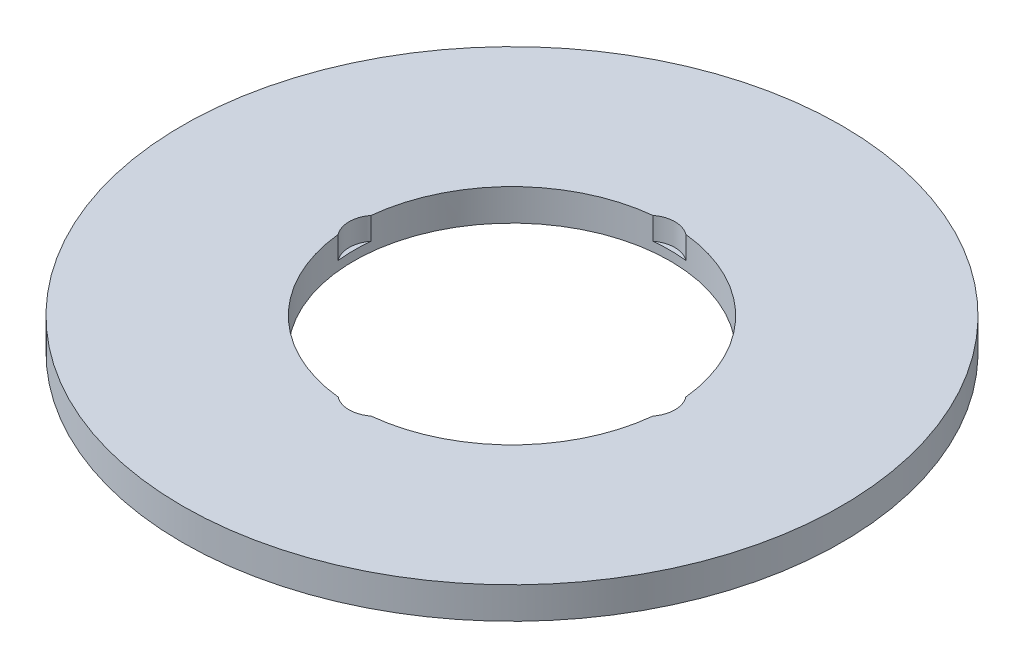
ISO-10303-21;
HEADER;
FILE_DESCRIPTION(('STEP AP214'),'2;1');
FILE_NAME('part.step','',(''),(''),'','','');
FILE_SCHEMA(('AUTOMOTIVE_DESIGN { 1 0 10303 214 1 1 1 1 }'));
ENDSEC;
DATA;
#1=APPLICATION_CONTEXT('core data for automotive mechanical design processes');
#2=APPLICATION_PROTOCOL_DEFINITION('international standard','automotive_design',2000,#1);
#3=PRODUCT_CONTEXT('',#1,'mechanical');
#4=PRODUCT('Part','Part','',(#3));
#5=PRODUCT_RELATED_PRODUCT_CATEGORY('part','',(#4));
#6=PRODUCT_DEFINITION_FORMATION('','',#4);
#7=PRODUCT_DEFINITION_CONTEXT('part definition',#1,'design');
#8=PRODUCT_DEFINITION('design','',#6,#7);
#9=PRODUCT_DEFINITION_SHAPE('','',#8);
#10=(LENGTH_UNIT() NAMED_UNIT(*) SI_UNIT(.MILLI.,.METRE.));
#11=(NAMED_UNIT(*) PLANE_ANGLE_UNIT() SI_UNIT($,.RADIAN.));
#12=(NAMED_UNIT(*) SI_UNIT($,.STERADIAN.) SOLID_ANGLE_UNIT());
#13=UNCERTAINTY_MEASURE_WITH_UNIT(LENGTH_MEASURE(1.E-05),#10,'distance_accuracy_value','');
#14=(GEOMETRIC_REPRESENTATION_CONTEXT(3) GLOBAL_UNCERTAINTY_ASSIGNED_CONTEXT((#13)) GLOBAL_UNIT_ASSIGNED_CONTEXT((#10,
#11,#12)) REPRESENTATION_CONTEXT('',''));
#15=CARTESIAN_POINT('',(0.,0.,0.));
#16=DIRECTION('',(0.,0.,1.));
#17=DIRECTION('',(1.,0.,0.));
#18=AXIS2_PLACEMENT_3D('',#15,#16,#17);
#19=CARTESIAN_POINT('',(0.,6.,0.));
#20=DIRECTION('',(0.,-1.,0.));
#21=DIRECTION('',(0.,0.,-1.));
#22=AXIS2_PLACEMENT_3D('',#19,#20,#21);
#23=CYLINDRICAL_SURFACE('',#22,62.5);
#24=CARTESIAN_POINT('',(0.,6.,0.));
#25=DIRECTION('',(0.,1.,0.));
#26=DIRECTION('',(0.,0.,1.));
#27=AXIS2_PLACEMENT_3D('',#24,#25,#26);
#28=CIRCLE('',#27,62.5);
#29=CARTESIAN_POINT('',(0.,6.,62.5));
#30=VERTEX_POINT('',#29);
#31=EDGE_CURVE('E148',#30,#30,#28,.T.);
#32=ORIENTED_EDGE('',*,*,#31,.F.);
#33=EDGE_LOOP('',(#32));
#34=FACE_BOUND('',#33,.T.);
#35=CARTESIAN_POINT('',(0.,0.,0.));
#36=DIRECTION('',(0.,1.,0.));
#37=DIRECTION('',(0.,0.,1.));
#38=AXIS2_PLACEMENT_3D('',#35,#36,#37);
#39=CIRCLE('',#38,62.5);
#40=CARTESIAN_POINT('',(0.,0.,62.5));
#41=VERTEX_POINT('',#40);
#42=EDGE_CURVE('E139',#41,#41,#39,.T.);
#43=ORIENTED_EDGE('',*,*,#42,.T.);
#44=EDGE_LOOP('',(#43));
#45=FACE_BOUND('',#44,.T.);
#46=ADVANCED_FACE('F39',(#34,#45),#23,.T.);
#47=CARTESIAN_POINT('',(0.,6.,0.));
#48=DIRECTION('',(0.,1.,0.));
#49=DIRECTION('',(0.,0.,1.));
#50=AXIS2_PLACEMENT_3D('',#47,#48,#49);
#51=PLANE('',#50);
#52=CARTESIAN_POINT('',(0.,6.,25.7846780299139));
#53=DIRECTION('',(0.,1.,0.));
#54=DIRECTION('',(1.,0.,0.));
#55=AXIS2_PLACEMENT_3D('',#52,#53,#54);
#56=CIRCLE('',#55,5.11808416303278);
#57=CARTESIAN_POINT('',(-3.12675897190396,6.,29.836611374813));
#58=VERTEX_POINT('',#57);
#59=CARTESIAN_POINT('',(3.12675897190417,6.,29.8366113748129));
#60=VERTEX_POINT('',#59);
#61=EDGE_CURVE('E175',#58,#60,#56,.T.);
#62=ORIENTED_EDGE('',*,*,#61,.F.);
#63=CARTESIAN_POINT('',(0.,6.,0.));
#64=DIRECTION('',(0.,1.,0.));
#65=DIRECTION('',(0.,0.,1.));
#66=AXIS2_PLACEMENT_3D('',#63,#64,#65);
#67=CIRCLE('',#66,30.);
#68=CARTESIAN_POINT('',(-29.8366113748129,6.,3.12675897190407));
#69=VERTEX_POINT('',#68);
#70=EDGE_CURVE('E134',#69,#58,#67,.T.);
#71=ORIENTED_EDGE('',*,*,#70,.F.);
#72=CARTESIAN_POINT('',(-25.7846780299139,6.,0.));
#73=DIRECTION('',(0.,1.,0.));
#74=DIRECTION('',(0.,0.,1.));
#75=AXIS2_PLACEMENT_3D('',#72,#73,#74);
#76=CIRCLE('',#75,5.11808416303278);
#77=CARTESIAN_POINT('',(-29.8366113748129,6.,-3.12675897190407));
#78=VERTEX_POINT('',#77);
#79=EDGE_CURVE('E143',#78,#69,#76,.T.);
#80=ORIENTED_EDGE('',*,*,#79,.F.);
#81=CARTESIAN_POINT('',(-3.12675897190438,6.,-29.8366113748129));
#82=VERTEX_POINT('',#81);
#83=EDGE_CURVE('E123',#82,#78,#67,.T.);
#84=ORIENTED_EDGE('',*,*,#83,.F.);
#85=CARTESIAN_POINT('',(-2.70080166508569E-13,6.,-25.7846780299139));
#86=DIRECTION('',(0.,1.,0.));
#87=DIRECTION('',(-1.,0.,0.));
#88=AXIS2_PLACEMENT_3D('',#85,#86,#87);
#89=CIRCLE('',#88,5.11808416303278);
#90=CARTESIAN_POINT('',(3.12675897190375,6.,-29.836611374813));
#91=VERTEX_POINT('',#90);
#92=EDGE_CURVE('E106',#91,#82,#89,.T.);
#93=ORIENTED_EDGE('',*,*,#92,.F.);
#94=CARTESIAN_POINT('',(29.8366113748129,6.,-3.12675897190407));
#95=VERTEX_POINT('',#94);
#96=EDGE_CURVE('E125',#95,#91,#67,.T.);
#97=ORIENTED_EDGE('',*,*,#96,.F.);
#98=CARTESIAN_POINT('',(25.7846780299139,6.,0.));
#99=DIRECTION('',(0.,1.,0.));
#100=DIRECTION('',(0.,0.,-1.));
#101=AXIS2_PLACEMENT_3D('',#98,#99,#100);
#102=CIRCLE('',#101,5.11808416303278);
#103=CARTESIAN_POINT('',(29.8366113748129,6.,3.12675897190407));
#104=VERTEX_POINT('',#103);
#105=EDGE_CURVE('E286',#104,#95,#102,.T.);
#106=ORIENTED_EDGE('',*,*,#105,.F.);
#107=EDGE_CURVE('E135',#60,#104,#67,.T.);
#108=ORIENTED_EDGE('',*,*,#107,.F.);
#109=EDGE_LOOP('',(#62,#71,#80,#84,#93,#97,#106,#108));
#110=FACE_BOUND('',#109,.T.);
#111=ORIENTED_EDGE('',*,*,#31,.T.);
#112=EDGE_LOOP('',(#111));
#113=FACE_BOUND('',#112,.T.);
#114=ADVANCED_FACE('F118',(#110,#113),#51,.T.);
#115=CARTESIAN_POINT('',(0.,0.,0.));
#116=DIRECTION('',(0.,1.,0.));
#117=DIRECTION('',(0.,0.,1.));
#118=AXIS2_PLACEMENT_3D('',#115,#116,#117);
#119=PLANE('',#118);
#120=CARTESIAN_POINT('',(0.,0.,0.));
#121=DIRECTION('',(0.,1.,0.));
#122=DIRECTION('',(0.,0.,1.));
#123=AXIS2_PLACEMENT_3D('',#120,#121,#122);
#124=CIRCLE('',#123,30.);
#125=CARTESIAN_POINT('',(0.,0.,30.));
#126=VERTEX_POINT('',#125);
#127=EDGE_CURVE('E136',#126,#126,#124,.T.);
#128=ORIENTED_EDGE('',*,*,#127,.T.);
#129=EDGE_LOOP('',(#128));
#130=FACE_BOUND('',#129,.T.);
#131=ORIENTED_EDGE('',*,*,#42,.F.);
#132=EDGE_LOOP('',(#131));
#133=FACE_BOUND('',#132,.T.);
#134=ADVANCED_FACE('F187',(#130,#133),#119,.F.);
#135=CARTESIAN_POINT('',(0.,6.,0.));
#136=DIRECTION('',(0.,-1.,0.));
#137=DIRECTION('',(0.,0.,-1.));
#138=AXIS2_PLACEMENT_3D('',#135,#136,#137);
#139=CYLINDRICAL_SURFACE('',#138,30.);
#140=DIRECTION('',(0.,1.,0.));
#141=VECTOR('',#140,1.);
#142=CARTESIAN_POINT('',(-3.12675897190399,3.87469657856684,29.8366113748129));
#143=LINE('',#142,#141);
#144=CARTESIAN_POINT('',(-3.12675897190396,1.74939315713368,29.836611374813));
#145=VERTEX_POINT('',#144);
#146=EDGE_CURVE('E11',#145,#58,#143,.T.);
#147=ORIENTED_EDGE('',*,*,#146,.F.);
#148=CARTESIAN_POINT('',(0.,1.74939315713368,0.));
#149=DIRECTION('',(0.,1.,0.));
#150=DIRECTION('',(0.,0.,1.));
#151=AXIS2_PLACEMENT_3D('',#148,#149,#150);
#152=CIRCLE('',#151,30.);
#153=CARTESIAN_POINT('',(3.12675897190417,1.74939315713368,29.8366113748129));
#154=VERTEX_POINT('',#153);
#155=EDGE_CURVE('E170',#145,#154,#152,.T.);
#156=ORIENTED_EDGE('',*,*,#155,.T.);
#157=DIRECTION('',(0.,1.,0.));
#158=VECTOR('',#157,1.);
#159=CARTESIAN_POINT('',(3.1267589719042,3.87469657856684,29.8366113748129));
#160=LINE('',#159,#158);
#161=EDGE_CURVE('E46',#60,#154,#160,.F.);
#162=ORIENTED_EDGE('',*,*,#161,.F.);
#163=ORIENTED_EDGE('',*,*,#107,.T.);
#164=DIRECTION('',(0.,1.,0.));
#165=VECTOR('',#164,1.);
#166=CARTESIAN_POINT('',(29.8366113748129,3.87469657856684,3.12675897190409));
#167=LINE('',#166,#165);
#168=CARTESIAN_POINT('',(29.8366113748129,1.74939315713368,3.12675897190407));
#169=VERTEX_POINT('',#168);
#170=EDGE_CURVE('E164',#169,#104,#167,.T.);
#171=ORIENTED_EDGE('',*,*,#170,.F.);
#172=CARTESIAN_POINT('',(0.,1.74939315713368,0.));
#173=DIRECTION('',(0.,1.,0.));
#174=DIRECTION('',(0.,0.,1.));
#175=AXIS2_PLACEMENT_3D('',#172,#173,#174);
#176=CIRCLE('',#175,30.);
#177=CARTESIAN_POINT('',(29.8366113748129,1.74939315713368,-3.12675897190407));
#178=VERTEX_POINT('',#177);
#179=EDGE_CURVE('E115',#169,#178,#176,.T.);
#180=ORIENTED_EDGE('',*,*,#179,.T.);
#181=DIRECTION('',(0.,1.,0.));
#182=VECTOR('',#181,1.);
#183=CARTESIAN_POINT('',(29.8366113748129,3.87469657856684,-3.12675897190409));
#184=LINE('',#183,#182);
#185=EDGE_CURVE('E131',#95,#178,#184,.F.);
#186=ORIENTED_EDGE('',*,*,#185,.F.);
#187=ORIENTED_EDGE('',*,*,#96,.T.);
#188=DIRECTION('',(0.,1.,0.));
#189=VECTOR('',#188,1.);
#190=CARTESIAN_POINT('',(3.12675897190378,3.87469657856684,-29.836611374813));
#191=LINE('',#190,#189);
#192=CARTESIAN_POINT('',(3.12675897190375,1.74939315713368,-29.836611374813));
#193=VERTEX_POINT('',#192);
#194=EDGE_CURVE('E105',#193,#91,#191,.T.);
#195=ORIENTED_EDGE('',*,*,#194,.F.);
#196=CARTESIAN_POINT('',(0.,1.74939315713368,0.));
#197=DIRECTION('',(0.,1.,0.));
#198=DIRECTION('',(0.,0.,1.));
#199=AXIS2_PLACEMENT_3D('',#196,#197,#198);
#200=CIRCLE('',#199,30.);
#201=CARTESIAN_POINT('',(-3.12675897190438,1.74939315713368,-29.8366113748129));
#202=VERTEX_POINT('',#201);
#203=EDGE_CURVE('E159',#193,#202,#200,.T.);
#204=ORIENTED_EDGE('',*,*,#203,.T.);
#205=DIRECTION('',(0.,1.,0.));
#206=VECTOR('',#205,1.);
#207=CARTESIAN_POINT('',(-3.12675897190441,3.87469657856684,-29.8366113748129));
#208=LINE('',#207,#206);
#209=EDGE_CURVE('E114',#82,#202,#208,.F.);
#210=ORIENTED_EDGE('',*,*,#209,.F.);
#211=ORIENTED_EDGE('',*,*,#83,.T.);
#212=DIRECTION('',(0.,1.,0.));
#213=VECTOR('',#212,1.);
#214=CARTESIAN_POINT('',(-29.8366113748129,3.87469657856684,-3.12675897190409));
#215=LINE('',#214,#213);
#216=CARTESIAN_POINT('',(-29.8366113748129,1.74939315713368,-3.12675897190407));
#217=VERTEX_POINT('',#216);
#218=EDGE_CURVE('E160',#217,#78,#215,.T.);
#219=ORIENTED_EDGE('',*,*,#218,.F.);
#220=CARTESIAN_POINT('',(0.,1.74939315713368,0.));
#221=DIRECTION('',(0.,1.,0.));
#222=DIRECTION('',(0.,0.,1.));
#223=AXIS2_PLACEMENT_3D('',#220,#221,#222);
#224=CIRCLE('',#223,30.);
#225=CARTESIAN_POINT('',(-29.8366113748129,1.74939315713368,3.12675897190407));
#226=VERTEX_POINT('',#225);
#227=EDGE_CURVE('E149',#217,#226,#224,.T.);
#228=ORIENTED_EDGE('',*,*,#227,.T.);
#229=DIRECTION('',(0.,1.,0.));
#230=VECTOR('',#229,1.);
#231=CARTESIAN_POINT('',(-29.8366113748129,3.87469657856684,3.12675897190409));
#232=LINE('',#231,#230);
#233=EDGE_CURVE('E152',#69,#226,#232,.F.);
#234=ORIENTED_EDGE('',*,*,#233,.F.);
#235=ORIENTED_EDGE('',*,*,#70,.T.);
#236=EDGE_LOOP('',(#147,#156,#162,#163,#171,#180,#186,#187,#195,#204,#210,#211,#219,#228,#234,#235));
#237=FACE_BOUND('',#236,.T.);
#238=ORIENTED_EDGE('',*,*,#127,.F.);
#239=EDGE_LOOP('',(#238));
#240=FACE_BOUND('',#239,.T.);
#241=ADVANCED_FACE('F126',(#237,#240),#139,.F.);
#242=CARTESIAN_POINT('',(-25.7846780299139,1.74939315713368,0.));
#243=DIRECTION('',(0.,1.,0.));
#244=DIRECTION('',(0.,0.,1.));
#245=AXIS2_PLACEMENT_3D('',#242,#243,#244);
#246=CYLINDRICAL_SURFACE('',#245,5.11808416303278);
#247=ORIENTED_EDGE('',*,*,#218,.T.);
#248=ORIENTED_EDGE('',*,*,#79,.T.);
#249=ORIENTED_EDGE('',*,*,#233,.T.);
#250=CARTESIAN_POINT('',(-25.7846780299139,1.74939315713368,0.));
#251=DIRECTION('',(0.,1.,0.));
#252=DIRECTION('',(0.,0.,1.));
#253=AXIS2_PLACEMENT_3D('',#250,#251,#252);
#254=CIRCLE('',#253,5.11808416303278);
#255=EDGE_CURVE('E144',#217,#226,#254,.T.);
#256=ORIENTED_EDGE('',*,*,#255,.F.);
#257=EDGE_LOOP('',(#247,#248,#249,#256));
#258=FACE_BOUND('',#257,.T.);
#259=ADVANCED_FACE('F200',(#258),#246,.F.);
#260=CARTESIAN_POINT('',(-25.7846780299139,1.74939315713368,0.));
#261=DIRECTION('',(0.,1.,0.));
#262=DIRECTION('',(0.,0.,1.));
#263=AXIS2_PLACEMENT_3D('',#260,#261,#262);
#264=PLANE('',#263);
#265=ORIENTED_EDGE('',*,*,#255,.T.);
#266=ORIENTED_EDGE('',*,*,#227,.F.);
#267=EDGE_LOOP('',(#265,#266));
#268=FACE_BOUND('',#267,.T.);
#269=ADVANCED_FACE('F201',(#268),#264,.T.);
#270=CARTESIAN_POINT('',(-2.70080166508569E-13,1.74939315713368,-25.7846780299139));
#271=DIRECTION('',(0.,1.,0.));
#272=DIRECTION('',(0.,0.,1.));
#273=AXIS2_PLACEMENT_3D('',#270,#271,#272);
#274=CYLINDRICAL_SURFACE('',#273,5.11808416303278);
#275=ORIENTED_EDGE('',*,*,#194,.T.);
#276=ORIENTED_EDGE('',*,*,#92,.T.);
#277=ORIENTED_EDGE('',*,*,#209,.T.);
#278=CARTESIAN_POINT('',(-2.70080166508569E-13,1.74939315713368,-25.7846780299139));
#279=DIRECTION('',(0.,1.,0.));
#280=DIRECTION('',(-1.,0.,0.));
#281=AXIS2_PLACEMENT_3D('',#278,#279,#280);
#282=CIRCLE('',#281,5.11808416303278);
#283=EDGE_CURVE('E107',#193,#202,#282,.T.);
#284=ORIENTED_EDGE('',*,*,#283,.F.);
#285=EDGE_LOOP('',(#275,#276,#277,#284));
#286=FACE_BOUND('',#285,.T.);
#287=ADVANCED_FACE('F102',(#286),#274,.F.);
#288=CARTESIAN_POINT('',(-2.70080166508569E-13,1.74939315713368,-25.7846780299139));
#289=DIRECTION('',(0.,1.,0.));
#290=DIRECTION('',(-1.,0.,0.));
#291=AXIS2_PLACEMENT_3D('',#288,#289,#290);
#292=PLANE('',#291);
#293=ORIENTED_EDGE('',*,*,#283,.T.);
#294=ORIENTED_EDGE('',*,*,#203,.F.);
#295=EDGE_LOOP('',(#293,#294));
#296=FACE_BOUND('',#295,.T.);
#297=ADVANCED_FACE('F209',(#296),#292,.T.);
#298=CARTESIAN_POINT('',(25.7846780299139,1.74939315713368,0.));
#299=DIRECTION('',(0.,1.,0.));
#300=DIRECTION('',(0.,0.,1.));
#301=AXIS2_PLACEMENT_3D('',#298,#299,#300);
#302=CYLINDRICAL_SURFACE('',#301,5.11808416303278);
#303=ORIENTED_EDGE('',*,*,#170,.T.);
#304=ORIENTED_EDGE('',*,*,#105,.T.);
#305=ORIENTED_EDGE('',*,*,#185,.T.);
#306=CARTESIAN_POINT('',(25.7846780299139,1.74939315713368,0.));
#307=DIRECTION('',(0.,1.,0.));
#308=DIRECTION('',(0.,0.,-1.));
#309=AXIS2_PLACEMENT_3D('',#306,#307,#308);
#310=CIRCLE('',#309,5.11808416303278);
#311=EDGE_CURVE('E56',#169,#178,#310,.T.);
#312=ORIENTED_EDGE('',*,*,#311,.F.);
#313=EDGE_LOOP('',(#303,#304,#305,#312));
#314=FACE_BOUND('',#313,.T.);
#315=ADVANCED_FACE('F213',(#314),#302,.F.);
#316=CARTESIAN_POINT('',(25.7846780299139,1.74939315713368,0.));
#317=DIRECTION('',(0.,1.,0.));
#318=DIRECTION('',(0.,0.,-1.));
#319=AXIS2_PLACEMENT_3D('',#316,#317,#318);
#320=PLANE('',#319);
#321=ORIENTED_EDGE('',*,*,#311,.T.);
#322=ORIENTED_EDGE('',*,*,#179,.F.);
#323=EDGE_LOOP('',(#321,#322));
#324=FACE_BOUND('',#323,.T.);
#325=ADVANCED_FACE('F179',(#324),#320,.T.);
#326=CARTESIAN_POINT('',(0.,1.74939315713368,25.7846780299139));
#327=DIRECTION('',(0.,1.,0.));
#328=DIRECTION('',(0.,0.,1.));
#329=AXIS2_PLACEMENT_3D('',#326,#327,#328);
#330=CYLINDRICAL_SURFACE('',#329,5.11808416303278);
#331=ORIENTED_EDGE('',*,*,#146,.T.);
#332=ORIENTED_EDGE('',*,*,#61,.T.);
#333=ORIENTED_EDGE('',*,*,#161,.T.);
#334=CARTESIAN_POINT('',(0.,1.74939315713368,25.7846780299139));
#335=DIRECTION('',(0.,1.,0.));
#336=DIRECTION('',(1.,0.,0.));
#337=AXIS2_PLACEMENT_3D('',#334,#335,#336);
#338=CIRCLE('',#337,5.11808416303278);
#339=EDGE_CURVE('E55',#145,#154,#338,.T.);
#340=ORIENTED_EDGE('',*,*,#339,.F.);
#341=EDGE_LOOP('',(#331,#332,#333,#340));
#342=FACE_BOUND('',#341,.T.);
#343=ADVANCED_FACE('F171',(#342),#330,.F.);
#344=CARTESIAN_POINT('',(0.,1.74939315713368,25.7846780299139));
#345=DIRECTION('',(0.,1.,0.));
#346=DIRECTION('',(1.,0.,0.));
#347=AXIS2_PLACEMENT_3D('',#344,#345,#346);
#348=PLANE('',#347);
#349=ORIENTED_EDGE('',*,*,#339,.T.);
#350=ORIENTED_EDGE('',*,*,#155,.F.);
#351=EDGE_LOOP('',(#349,#350));
#352=FACE_BOUND('',#351,.T.);
#353=ADVANCED_FACE('F173',(#352),#348,.T.);
#354=CLOSED_SHELL('',(#46,#114,#134,#241,#259,#269,#287,#297,#315,#325,#343,#353));
#355=MANIFOLD_SOLID_BREP('B2',#354);
#356=ADVANCED_BREP_SHAPE_REPRESENTATION('',(#18,#355),#14);
#357=SHAPE_DEFINITION_REPRESENTATION(#9,#356);
ENDSEC;
END-ISO-10303-21;
